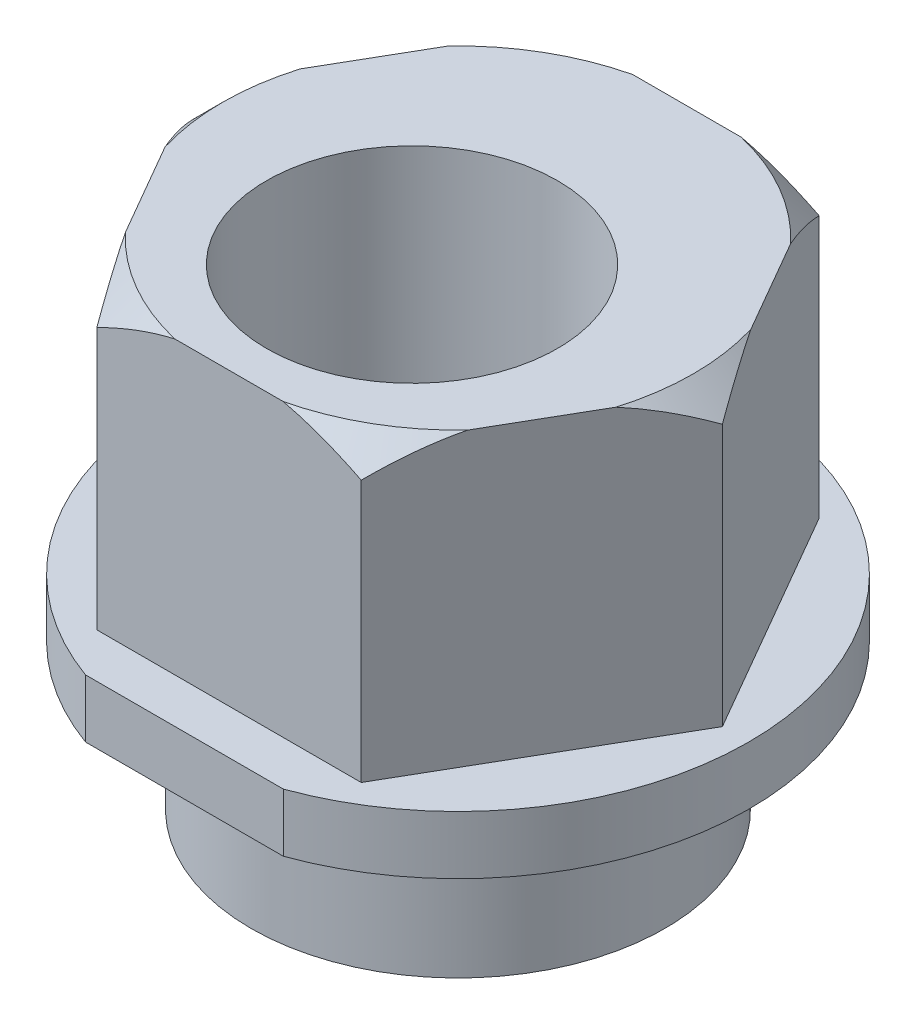
ISO-10303-21;
HEADER;
FILE_DESCRIPTION(('STEP AP214'),'2;1');
FILE_NAME('part.step','',(''),(''),'','','');
FILE_SCHEMA(('AUTOMOTIVE_DESIGN { 1 0 10303 214 1 1 1 1 }'));
ENDSEC;
DATA;
#1=APPLICATION_CONTEXT('core data for automotive mechanical design processes');
#2=APPLICATION_PROTOCOL_DEFINITION('international standard','automotive_design',2000,#1);
#3=PRODUCT_CONTEXT('',#1,'mechanical');
#4=PRODUCT('Part','Part','',(#3));
#5=PRODUCT_RELATED_PRODUCT_CATEGORY('part','',(#4));
#6=PRODUCT_DEFINITION_FORMATION('','',#4);
#7=PRODUCT_DEFINITION_CONTEXT('part definition',#1,'design');
#8=PRODUCT_DEFINITION('design','',#6,#7);
#9=PRODUCT_DEFINITION_SHAPE('','',#8);
#10=(LENGTH_UNIT() NAMED_UNIT(*) SI_UNIT(.MILLI.,.METRE.));
#11=(NAMED_UNIT(*) PLANE_ANGLE_UNIT() SI_UNIT($,.RADIAN.));
#12=(NAMED_UNIT(*) SI_UNIT($,.STERADIAN.) SOLID_ANGLE_UNIT());
#13=UNCERTAINTY_MEASURE_WITH_UNIT(LENGTH_MEASURE(1.E-05),#10,'distance_accuracy_value','');
#14=(GEOMETRIC_REPRESENTATION_CONTEXT(3) GLOBAL_UNCERTAINTY_ASSIGNED_CONTEXT((#13)) GLOBAL_UNIT_ASSIGNED_CONTEXT((#10,
#11,#12)) REPRESENTATION_CONTEXT('',''));
#15=CARTESIAN_POINT('',(0.,0.,0.));
#16=DIRECTION('',(0.,0.,1.));
#17=DIRECTION('',(1.,0.,0.));
#18=AXIS2_PLACEMENT_3D('',#15,#16,#17);
#19=CARTESIAN_POINT('',(0.,-1.,0.));
#20=DIRECTION('',(0.,1.,0.));
#21=DIRECTION('',(0.,0.,1.));
#22=AXIS2_PLACEMENT_3D('',#19,#20,#21);
#23=PLANE('',#22);
#24=CARTESIAN_POINT('',(0.,-1.,0.));
#25=DIRECTION('',(0.,1.,0.));
#26=DIRECTION('',(0.,0.,1.));
#27=AXIS2_PLACEMENT_3D('',#24,#25,#26);
#28=CIRCLE('',#27,5.);
#29=CARTESIAN_POINT('',(1.7,-1.,4.7021271782035));
#30=VERTEX_POINT('',#29);
#31=CARTESIAN_POINT('',(-1.7,-1.,4.7021271782035));
#32=VERTEX_POINT('',#31);
#33=EDGE_CURVE('E221',#30,#32,#28,.T.);
#34=ORIENTED_EDGE('',*,*,#33,.F.);
#35=DIRECTION('',(-1.,0.,0.));
#36=VECTOR('',#35,1.);
#37=CARTESIAN_POINT('',(0.,-1.,4.7021271782035));
#38=LINE('',#37,#36);
#39=EDGE_CURVE('E336',#30,#32,#38,.T.);
#40=ORIENTED_EDGE('',*,*,#39,.T.);
#41=EDGE_LOOP('',(#34,#40));
#42=FACE_BOUND('',#41,.T.);
#43=CARTESIAN_POINT('',(0.,-1.,0.));
#44=DIRECTION('',(0.,1.,0.));
#45=DIRECTION('',(0.,0.,1.));
#46=AXIS2_PLACEMENT_3D('',#43,#44,#45);
#47=CIRCLE('',#46,3.555);
#48=CARTESIAN_POINT('',(0.,-1.,3.555));
#49=VERTEX_POINT('',#48);
#50=EDGE_CURVE('E166',#49,#49,#47,.F.);
#51=ORIENTED_EDGE('',*,*,#50,.F.);
#52=EDGE_LOOP('',(#51));
#53=FACE_BOUND('',#52,.T.);
#54=ADVANCED_FACE('F34',(#42,#53),#23,.F.);
#55=CARTESIAN_POINT('',(2.27187330926118,5.,3.935));
#56=DIRECTION('',(-0.866025403784439,0.,-0.5));
#57=DIRECTION('',(-0.5,0.,0.866025403784439));
#58=AXIS2_PLACEMENT_3D('',#55,#56,#57);
#59=PLANE('',#58);
#60=DIRECTION('',(0.,-1.,0.));
#61=VECTOR('',#60,1.);
#62=CARTESIAN_POINT('',(4.54374661852235,5.,0.));
#63=LINE('',#62,#61);
#64=CARTESIAN_POINT('',(4.54374661852235,4.5,0.));
#65=VERTEX_POINT('',#64);
#66=CARTESIAN_POINT('',(4.54374661852235,0.,0.));
#67=VERTEX_POINT('',#66);
#68=EDGE_CURVE('E163',#65,#67,#63,.T.);
#69=ORIENTED_EDGE('',*,*,#68,.F.);
#70=CARTESIAN_POINT('',(6.12736327266163,2.33046829888115,-2.74290450468147));
#71=CARTESIAN_POINT('',(6.07348339276709,2.4177650828994,-2.64958181519841));
#72=CARTESIAN_POINT('',(6.01938921555573,2.50453762285222,-2.55588795187471));
#73=CARTESIAN_POINT('',(5.91069789973588,2.67683309661582,-2.36762907053321));
#74=CARTESIAN_POINT('',(5.85610071578471,2.76235591593962,-2.27306397397959));
#75=CARTESIAN_POINT('',(5.74620735938589,2.9321379387506,-2.08272309728255));
#76=CARTESIAN_POINT('',(5.6909098259844,3.01639362513631,-1.98694495989795));
#77=CARTESIAN_POINT('',(5.57966030231228,3.18315508159383,-1.79425513258));
#78=CARTESIAN_POINT('',(5.52370832991605,3.26566089928668,-1.69734347360602));
#79=CARTESIAN_POINT('',(5.40948255505868,3.43085092459455,-1.49949862801914));
#80=CARTESIAN_POINT('',(5.3511874452437,3.51347634106705,-1.3985285359868));
#81=CARTESIAN_POINT('',(5.23367321649109,3.67605365317037,-1.194987921175));
#82=CARTESIAN_POINT('',(5.17445413325307,3.75600565172091,-1.09241746022911));
#83=CARTESIAN_POINT('',(5.05499257757878,3.9125743398257,-0.885503976250002));
#84=CARTESIAN_POINT('',(4.99475102957391,3.98919384008597,-0.78116255437897));
#85=CARTESIAN_POINT('',(4.873034492307,4.1383918042904,-0.570343327711337));
#86=CARTESIAN_POINT('',(4.81155966257741,4.21097078637303,-0.463865799233039));
#87=CARTESIAN_POINT('',(4.68581480841085,4.35265115676022,-0.246069323026223));
#88=CARTESIAN_POINT('',(4.62151303943029,4.42164059850529,-0.134695392135335));
#89=CARTESIAN_POINT('',(4.4912183922476,4.55301635986169,0.090981556739347));
#90=CARTESIAN_POINT('',(4.42522527529575,4.61540174079966,0.205284988249787));
#91=CARTESIAN_POINT('',(4.29176890522431,4.73150823576122,0.436438201807242));
#92=CARTESIAN_POINT('',(4.22431561588303,4.78527468558276,0.553270726083977));
#93=CARTESIAN_POINT('',(4.08756303909753,4.88247623364584,0.790133137142428));
#94=CARTESIAN_POINT('',(4.01826431274338,4.92591443311341,0.910162052087628));
#95=CARTESIAN_POINT('',(3.89160680975576,4.99299560676046,1.129539282422));
#96=CARTESIAN_POINT('',(3.83454175212893,5.01884439579798,1.22837886156851));
#97=CARTESIAN_POINT('',(3.71955042243969,5.06126068823275,1.42754968702018));
#98=CARTESIAN_POINT('',(3.66162427680432,5.0778295405829,1.52788071434728));
#99=CARTESIAN_POINT('',(3.54536540774452,5.10083438466152,1.72924698238935));
#100=CARTESIAN_POINT('',(3.4870335640049,5.1072879053957,1.83028069944554));
#101=CARTESIAN_POINT('',(3.37031281221754,5.10976287991731,2.03244697183888));
#102=CARTESIAN_POINT('',(3.31192390350574,5.10578421082689,2.13357952832621));
#103=CARTESIAN_POINT('',(3.19571069696838,5.08764038060559,2.33486670655941));
#104=CARTESIAN_POINT('',(3.13788528988516,5.07350318473267,2.43502324959591));
#105=CARTESIAN_POINT('',(3.02300572590152,5.03579603444199,2.63400049116693));
#106=CARTESIAN_POINT('',(2.96595175572664,5.01222383709666,2.73282086628335));
#107=CARTESIAN_POINT('',(2.85271904802042,4.95661618256865,2.9289456691091));
#108=CARTESIAN_POINT('',(2.79654337792266,4.92455603960202,3.02624478386765));
#109=CARTESIAN_POINT('',(2.68537248742994,4.85318593152667,3.21879841452373));
#110=CARTESIAN_POINT('',(2.63037720983353,4.81387631861451,3.31405302949706));
#111=CARTESIAN_POINT('',(2.5019161833033,4.71383121159169,3.53655405423988));
#112=CARTESIAN_POINT('',(2.42896022795634,4.65048731772351,3.66291747561553));
#113=CARTESIAN_POINT('',(2.28511505424096,4.51496245516658,3.91206462491415));
#114=CARTESIAN_POINT('',(2.2142269607044,4.44277678394606,4.03484640457117));
#115=CARTESIAN_POINT('',(2.07416708594693,4.29140781010891,4.27743722375284));
#116=CARTESIAN_POINT('',(2.00499919286836,4.21221022636325,4.39723952881742));
#117=CARTESIAN_POINT('',(1.86828970424628,4.04847541244671,4.63402730898762));
#118=CARTESIAN_POINT('',(1.80074782327538,3.96393912900212,4.75101327846797));
#119=CARTESIAN_POINT('',(1.6667324101583,3.790255628053,4.9831347829841));
#120=CARTESIAN_POINT('',(1.60026513983173,3.70108917509827,5.09825947223014));
#121=CARTESIAN_POINT('',(1.46849790545969,3.51936003005431,5.32648701693534));
#122=CARTESIAN_POINT('',(1.40319803917282,3.42679705550268,5.43958970307165));
#123=CARTESIAN_POINT('',(1.27366225353528,3.23904020589262,5.66395226519422));
#124=CARTESIAN_POINT('',(1.20942525212282,3.14384930831284,5.77521401536649));
#125=CARTESIAN_POINT('',(1.08179181966025,2.9512386314917,5.99628160513605));
#126=CARTESIAN_POINT('',(1.01839540535985,2.85381880794148,6.10608741572204));
#127=CARTESIAN_POINT('',(0.910409016945997,2.6853578347565,6.2931253269807));
#128=CARTESIAN_POINT('',(0.865642352807006,2.61476846228915,6.3706634637548));
#129=CARTESIAN_POINT('',(0.776622094234247,2.47305833440251,6.52485107450574));
#130=CARTESIAN_POINT('',(0.732367142810404,2.40194099006958,6.60150289885833));
#131=CARTESIAN_POINT('',(0.688256655121896,2.33046829888115,6.67790450468147));
#132=B_SPLINE_CURVE_WITH_KNOTS('',3,(#70,#71,#72,#73,#74,#75,#76,#77,#78,#79,#80,#81,#82,#83,
#84,#85,#86,#87,#88,#89,#90,#91,#92,#93,#94,#95,#96,#97,#98,#99,#100,#101,#102,#103,#104,#105,
#106,#107,#108,#109,#110,#111,#112,#113,#114,#115,#116,#117,#118,#119,#120,#121,#122,#123,#124,
#125,#126,#127,#128,#129,#130,#131),.UNSPECIFIED.,.F.,.F.,(4,2,2,2,2,2,2,2,2,2,2,2,2,2,2,2,2,2,
2,2,2,2,2,2,2,2,2,2,2,2,4),(0.,0.416050988652375,0.832139855784054,1.24922530063749,
1.6662993802975,2.09496685038955,2.52361779884089,2.95189991005181,3.38012697311563,
3.81779500231414,4.25552515650994,4.69087140580247,5.12608676971888,5.4768138337239,
5.82748990199696,6.17755760407587,6.52762942952254,6.87674122143841,7.22593605499141,
7.5761578380004,7.92636261087879,8.40316579002672,8.88022366888807,9.35827656071276,
9.83624491486482,10.316388748245,10.7965726023688,11.2762330860941,11.7559031133002,
12.0979389750605,12.4385584137849),.UNSPECIFIED.);
#133=CARTESIAN_POINT('',(3.87355176865353,5.,1.1608115309438));
#134=VERTEX_POINT('',#133);
#135=EDGE_CURVE('E313',#65,#134,#132,.T.);
#136=ORIENTED_EDGE('',*,*,#135,.T.);
#137=DIRECTION('',(0.5,0.,-0.866025403784439));
#138=VECTOR('',#137,1.);
#139=CARTESIAN_POINT('',(2.27187330926118,5.,3.935));
#140=LINE('',#139,#138);
#141=CARTESIAN_POINT('',(2.94206815913,5.,2.7741884690562));
#142=VERTEX_POINT('',#141);
#143=EDGE_CURVE('E233',#142,#134,#140,.T.);
#144=ORIENTED_EDGE('',*,*,#143,.F.);
#145=CARTESIAN_POINT('',(2.27187330926118,4.5,3.935));
#146=VERTEX_POINT('',#145);
#147=EDGE_CURVE('E250',#142,#146,#132,.T.);
#148=ORIENTED_EDGE('',*,*,#147,.T.);
#149=DIRECTION('',(0.,-1.,0.));
#150=VECTOR('',#149,1.);
#151=CARTESIAN_POINT('',(2.27187330926118,5.,3.935));
#152=LINE('',#151,#150);
#153=CARTESIAN_POINT('',(2.27187330926118,0.,3.935));
#154=VERTEX_POINT('',#153);
#155=EDGE_CURVE('E217',#146,#154,#152,.T.);
#156=ORIENTED_EDGE('',*,*,#155,.T.);
#157=DIRECTION('',(0.5,0.,-0.866025403784439));
#158=VECTOR('',#157,1.);
#159=CARTESIAN_POINT('',(2.27187330926118,0.,3.935));
#160=LINE('',#159,#158);
#161=EDGE_CURVE('E218',#154,#67,#160,.T.);
#162=ORIENTED_EDGE('',*,*,#161,.T.);
#163=EDGE_LOOP('',(#69,#136,#144,#148,#156,#162));
#164=FACE_BOUND('',#163,.T.);
#165=ADVANCED_FACE('F36',(#164),#59,.F.);
#166=CARTESIAN_POINT('',(4.54374661852235,5.,0.));
#167=DIRECTION('',(-0.866025403784438,0.,0.5));
#168=DIRECTION('',(0.5,0.,0.866025403784438));
#169=AXIS2_PLACEMENT_3D('',#166,#167,#168);
#170=PLANE('',#169);
#171=DIRECTION('',(0.,-1.,0.));
#172=VECTOR('',#171,1.);
#173=CARTESIAN_POINT('',(2.27187330926118,5.,-3.935));
#174=LINE('',#173,#172);
#175=CARTESIAN_POINT('',(2.27187330926118,4.5,-3.935));
#176=VERTEX_POINT('',#175);
#177=CARTESIAN_POINT('',(2.27187330926118,0.,-3.935));
#178=VERTEX_POINT('',#177);
#179=EDGE_CURVE('E152',#176,#178,#174,.T.);
#180=ORIENTED_EDGE('',*,*,#179,.F.);
#181=CARTESIAN_POINT('',(0.688256655121894,2.33046829888116,-6.67790450468146));
#182=CARTESIAN_POINT('',(0.742136535016436,2.4177650828994,-6.58458181519841));
#183=CARTESIAN_POINT('',(0.796230712227795,2.50453762285222,-6.4908879518747));
#184=CARTESIAN_POINT('',(0.904922028047648,2.67683309661582,-6.3026290705332));
#185=CARTESIAN_POINT('',(0.959519211998818,2.76235591593963,-6.20806397397959));
#186=CARTESIAN_POINT('',(1.06941256839764,2.93213793875061,-6.01772309728255));
#187=CARTESIAN_POINT('',(1.12471010179913,3.01639362513632,-5.92194495989794));
#188=CARTESIAN_POINT('',(1.23595962547125,3.18315508159383,-5.72925513257999));
#189=CARTESIAN_POINT('',(1.29191159786749,3.26566089928668,-5.63234347360602));
#190=CARTESIAN_POINT('',(1.40613737272485,3.43085092459456,-5.43449862801913));
#191=CARTESIAN_POINT('',(1.46443248253983,3.51347634106706,-5.33352853598679));
#192=CARTESIAN_POINT('',(1.58194671129244,3.67605365317038,-5.12998792117499));
#193=CARTESIAN_POINT('',(1.64116579453046,3.75600565172092,-5.0274174602291));
#194=CARTESIAN_POINT('',(1.76062735020476,3.9125743398257,-4.82050397624999));
#195=CARTESIAN_POINT('',(1.82086889820963,3.98919384008598,-4.71616255437896));
#196=CARTESIAN_POINT('',(1.94258543547653,4.1383918042904,-4.50534332771133));
#197=CARTESIAN_POINT('',(2.00406026520612,4.21097078637303,-4.39886579923303));
#198=CARTESIAN_POINT('',(2.12980511937268,4.35265115676022,-4.18106932302621));
#199=CARTESIAN_POINT('',(2.19410688835324,4.4216405985053,-4.06969539213533));
#200=CARTESIAN_POINT('',(2.32440153553593,4.5530163598617,-3.84401844326064));
#201=CARTESIAN_POINT('',(2.39039465248778,4.61540174079966,-3.7297150117502));
#202=CARTESIAN_POINT('',(2.52385102255923,4.73150823576123,-3.49856179819275));
#203=CARTESIAN_POINT('',(2.5913043119005,4.78527468558276,-3.38172927391602));
#204=CARTESIAN_POINT('',(2.728056888686,4.88247623364584,-3.14486686285757));
#205=CARTESIAN_POINT('',(2.79735561504015,4.92591443311342,-3.02483794791237));
#206=CARTESIAN_POINT('',(2.92401311802778,4.99299560676046,-2.805460717578));
#207=CARTESIAN_POINT('',(2.98107817565461,5.01884439579799,-2.70662113843148));
#208=CARTESIAN_POINT('',(3.09606950534385,5.06126068823276,-2.50745031297981));
#209=CARTESIAN_POINT('',(3.15399565097922,5.0778295405829,-2.40711928565272));
#210=CARTESIAN_POINT('',(3.27025452003902,5.10083438466152,-2.20575301761065));
#211=CARTESIAN_POINT('',(3.32858636377864,5.1072879053957,-2.10471930055446));
#212=CARTESIAN_POINT('',(3.445307115566,5.10976287991731,-1.90255302816112));
#213=CARTESIAN_POINT('',(3.50369602427779,5.10578421082689,-1.80142047167379));
#214=CARTESIAN_POINT('',(3.61990923081515,5.08764038060559,-1.60013329344058));
#215=CARTESIAN_POINT('',(3.67773463789837,5.07350318473267,-1.49997675040409));
#216=CARTESIAN_POINT('',(3.79261420188202,5.03579603444199,-1.30099950883306));
#217=CARTESIAN_POINT('',(3.8496681720569,5.01222383709666,-1.20217913371665));
#218=CARTESIAN_POINT('',(3.96290087976311,4.95661618256865,-1.00605433089089));
#219=CARTESIAN_POINT('',(4.01907654986087,4.92455603960202,-0.908755216132345));
#220=CARTESIAN_POINT('',(4.13024744035359,4.85318593152667,-0.716201585476272));
#221=CARTESIAN_POINT('',(4.18524271795,4.81387631861451,-0.620946970502936));
#222=CARTESIAN_POINT('',(4.31370374448024,4.71383121159169,-0.398445945760117));
#223=CARTESIAN_POINT('',(4.38665969982719,4.6504873177235,-0.272082524384468));
#224=CARTESIAN_POINT('',(4.53050487354258,4.51496245516658,-0.0229353750858439));
#225=CARTESIAN_POINT('',(4.60139296707914,4.44277678394605,0.0998464045711766));
#226=CARTESIAN_POINT('',(4.74145284183661,4.2914078101089,0.342437223752842));
#227=CARTESIAN_POINT('',(4.81062073491518,4.21221022636324,0.462239528817422));
#228=CARTESIAN_POINT('',(4.94733022353726,4.0484754124467,0.699027308987622));
#229=CARTESIAN_POINT('',(5.01487210450815,3.96393912900211,0.81601327846798));
#230=CARTESIAN_POINT('',(5.14888751762524,3.79025562805299,1.04813478298411));
#231=CARTESIAN_POINT('',(5.21535478795181,3.70108917509827,1.16325947223014));
#232=CARTESIAN_POINT('',(5.34712202232385,3.5193600300543,1.39148701693534));
#233=CARTESIAN_POINT('',(5.41242188861072,3.42679705550267,1.50458970307166));
#234=CARTESIAN_POINT('',(5.54195767424825,3.23904020589262,1.72895226519422));
#235=CARTESIAN_POINT('',(5.60619467566072,3.14384930831283,1.84021401536649));
#236=CARTESIAN_POINT('',(5.73382810812329,2.95123863149169,2.06128160513606));
#237=CARTESIAN_POINT('',(5.79722452242369,2.85381880794147,2.17108741572204));
#238=CARTESIAN_POINT('',(5.90521091083754,2.68535783475649,2.3581253269807));
#239=CARTESIAN_POINT('',(5.94997757497653,2.61476846228915,2.43566346375481));
#240=CARTESIAN_POINT('',(6.03899783354929,2.47305833440251,2.58985107450574));
#241=CARTESIAN_POINT('',(6.08325278497313,2.40194099006958,2.66650289885833));
#242=CARTESIAN_POINT('',(6.12736327266164,2.33046829888115,2.74290450468146));
#243=B_SPLINE_CURVE_WITH_KNOTS('',3,(#181,#182,#183,#184,#185,#186,#187,#188,#189,#190,#191,
#192,#193,#194,#195,#196,#197,#198,#199,#200,#201,#202,#203,#204,#205,#206,#207,#208,#209,#210,
#211,#212,#213,#214,#215,#216,#217,#218,#219,#220,#221,#222,#223,#224,#225,#226,#227,#228,#229,
#230,#231,#232,#233,#234,#235,#236,#237,#238,#239,#240,#241,#242),.UNSPECIFIED.,.F.,.F.,(4,2,2,
2,2,2,2,2,2,2,2,2,2,2,2,2,2,2,2,2,2,2,2,2,2,2,2,2,2,2,4),(0.,0.416050988652376,
0.832139855784055,1.24922530063749,1.66629938029751,2.09496685038956,2.5236177988409,
2.95189991005182,3.38012697311563,3.81779500231415,4.25552515650994,4.69087140580247,
5.12608676971889,5.4768138337239,5.82748990199696,6.17755760407587,6.52762942952254,
6.87674122143841,7.22593605499141,7.57615783800039,7.92636261087879,8.40316579002672,
8.88022366888807,9.35827656071276,9.83624491486482,10.316388748245,10.7965726023688,
11.2762330860941,11.7559031133002,12.0979389750605,12.4385584137849),.UNSPECIFIED.);
#244=CARTESIAN_POINT('',(2.94206815913,5.,-2.7741884690562));
#245=VERTEX_POINT('',#244);
#246=EDGE_CURVE('E135',#176,#245,#243,.T.);
#247=ORIENTED_EDGE('',*,*,#246,.T.);
#248=DIRECTION('',(-0.5,0.,-0.866025403784438));
#249=VECTOR('',#248,1.);
#250=CARTESIAN_POINT('',(4.54374661852235,5.,0.));
#251=LINE('',#250,#249);
#252=CARTESIAN_POINT('',(3.87355176865353,5.,-1.1608115309438));
#253=VERTEX_POINT('',#252);
#254=EDGE_CURVE('E211',#253,#245,#251,.T.);
#255=ORIENTED_EDGE('',*,*,#254,.F.);
#256=EDGE_CURVE('E145',#253,#65,#243,.T.);
#257=ORIENTED_EDGE('',*,*,#256,.T.);
#258=ORIENTED_EDGE('',*,*,#68,.T.);
#259=DIRECTION('',(-0.5,0.,-0.866025403784438));
#260=VECTOR('',#259,1.);
#261=CARTESIAN_POINT('',(4.54374661852235,0.,0.));
#262=LINE('',#261,#260);
#263=EDGE_CURVE('E162',#67,#178,#262,.T.);
#264=ORIENTED_EDGE('',*,*,#263,.T.);
#265=EDGE_LOOP('',(#180,#247,#255,#257,#258,#264));
#266=FACE_BOUND('',#265,.T.);
#267=ADVANCED_FACE('F160',(#266),#170,.F.);
#268=CARTESIAN_POINT('',(2.27187330926118,5.,-3.935));
#269=DIRECTION('',(0.,0.,1.));
#270=DIRECTION('',(1.,0.,0.));
#271=AXIS2_PLACEMENT_3D('',#268,#269,#270);
#272=PLANE('',#271);
#273=DIRECTION('',(0.,-1.,0.));
#274=VECTOR('',#273,1.);
#275=CARTESIAN_POINT('',(-2.27187330926118,5.,-3.935));
#276=LINE('',#275,#274);
#277=CARTESIAN_POINT('',(-2.27187330926118,4.5,-3.935));
#278=VERTEX_POINT('',#277);
#279=CARTESIAN_POINT('',(-2.27187330926118,0.,-3.935));
#280=VERTEX_POINT('',#279);
#281=EDGE_CURVE('E164',#278,#280,#276,.T.);
#282=ORIENTED_EDGE('',*,*,#281,.F.);
#283=CARTESIAN_POINT('',(-5.01477781394264,2.6694057488158,-3.935));
#284=CARTESIAN_POINT('',(-4.90228240032233,2.75789162999437,-3.935));
#285=CARTESIAN_POINT('',(-4.78924605492269,2.84569863662638,-3.935));
#286=CARTESIAN_POINT('',(-4.56188241632701,3.01966288534844,-3.935));
#287=CARTESIAN_POINT('',(-4.44755491307628,3.10581985266844,-3.935));
#288=CARTESIAN_POINT('',(-4.21685222046402,3.27659538663721,-3.935));
#289=CARTESIAN_POINT('',(-4.10046957789372,3.36120391114583,-3.935));
#290=CARTESIAN_POINT('',(-3.86599418351296,3.52801066974508,-3.935));
#291=CARTESIAN_POINT('',(-3.74790151420127,3.61020901953759,-3.935));
#292=CARTESIAN_POINT('',(-3.50380543280417,3.77568927594522,-3.935));
#293=CARTESIAN_POINT('',(-3.3777005297054,3.85882204730453,-3.935));
#294=CARTESIAN_POINT('',(-3.12293409141574,4.0210686075328,-3.935));
#295=CARTESIAN_POINT('',(-2.99427277147477,4.10018273279293,-3.935));
#296=CARTESIAN_POINT('',(-2.7342134500717,4.25322326602883,-3.935));
#297=CARTESIAN_POINT('',(-2.60282112402671,4.32715926211431,-3.935));
#298=CARTESIAN_POINT('',(-2.33665993470769,4.46865096658867,-3.935));
#299=CARTESIAN_POINT('',(-2.20189200633557,4.53620841737975,-3.935));
#300=CARTESIAN_POINT('',(-1.94277039794665,4.65662539379787,-3.935));
#301=CARTESIAN_POINT('',(-1.81879024517606,4.7102827638368,-3.935));
#302=CARTESIAN_POINT('',(-1.56760322182998,4.80956431437058,-3.935));
#303=CARTESIAN_POINT('',(-1.4403960426367,4.8551877231961,-3.935));
#304=CARTESIAN_POINT('',(-1.18430895439847,4.93616339546024,-3.935));
#305=CARTESIAN_POINT('',(-1.05546474171029,4.97162701315895,-3.935));
#306=CARTESIAN_POINT('',(-0.795188728182397,5.03120060018271,-3.935));
#307=CARTESIAN_POINT('',(-0.663757985336443,5.05531511515621,-3.935));
#308=CARTESIAN_POINT('',(-0.39667530812576,5.09105643721047,-3.935));
#309=CARTESIAN_POINT('',(-0.260990364554486,5.10244193256667,-3.935));
#310=CARTESIAN_POINT('',(0.0108256286758382,5.11107629854814,-3.935));
#311=CARTESIAN_POINT('',(0.146956639108313,5.10832638056083,-3.935));
#312=CARTESIAN_POINT('',(0.418619878870053,5.08887050209526,-3.935));
#313=CARTESIAN_POINT('',(0.554148970208934,5.0721215602934,-3.935));
#314=CARTESIAN_POINT('',(0.822982454746628,5.02579152850102,-3.935));
#315=CARTESIAN_POINT('',(0.956286242224141,4.99620700199297,-3.935));
#316=CARTESIAN_POINT('',(1.26105655280132,4.91498323631563,-3.935));
#317=CARTESIAN_POINT('',(1.43144793684183,4.85934235740488,-3.935));
#318=CARTESIAN_POINT('',(1.76659971199313,4.73318715507506,-3.935));
#319=CARTESIAN_POINT('',(1.93135663408204,4.66266385383244,-3.935));
#320=CARTESIAN_POINT('',(2.25670464302017,4.50985567629177,-3.935));
#321=CARTESIAN_POINT('',(2.41725700907644,4.42748946751823,-3.935));
#322=CARTESIAN_POINT('',(2.7335996666453,4.25424890954647,-3.935));
#323=CARTESIAN_POINT('',(2.88939106725242,4.16337656225559,-3.935));
#324=CARTESIAN_POINT('',(3.2171018287942,3.96289685347115,-3.935));
#325=CARTESIAN_POINT('',(3.38846902004868,3.85239290462363,-3.935));
#326=CARTESIAN_POINT('',(3.7271209143155,3.62526903861077,-3.935));
#327=CARTESIAN_POINT('',(3.89440474117752,3.50864782550207,-3.935));
#328=CARTESIAN_POINT('',(4.22200861608271,3.27340163426143,-3.935));
#329=CARTESIAN_POINT('',(4.38240091884256,3.15487687320021,-3.935));
#330=CARTESIAN_POINT('',(4.6209837589724,2.97456068361506,-3.935));
#331=CARTESIAN_POINT('',(4.70015123515769,2.91405422097405,-3.935));
#332=CARTESIAN_POINT('',(4.85789331048121,2.79227931530866,-3.935));
#333=CARTESIAN_POINT('',(4.93646793238964,2.73101090179094,-3.935));
#334=CARTESIAN_POINT('',(5.01477781394264,2.6694057488158,-3.935));
#335=B_SPLINE_CURVE_WITH_KNOTS('',3,(#283,#284,#285,#286,#287,#288,#289,#290,#291,#292,#293,
#294,#295,#296,#297,#298,#299,#300,#301,#302,#303,#304,#305,#306,#307,#308,#309,#310,#311,#312,
#313,#314,#315,#316,#317,#318,#319,#320,#321,#322,#323,#324,#325,#326,#327,#328,#329,#330,#331,
#332,#333,#334),.UNSPECIFIED.,.F.,.F.,(4,2,2,2,2,2,2,2,2,2,2,2,2,2,2,2,2,2,2,2,2,2,2,2,2,4),(0.,
0.429382623340998,0.858836137877717,1.29047192805164,1.72208696325132,2.17515026344406,
2.62817557609088,3.08033856015113,3.53237766908385,3.9374314291705,4.34252407384557,
4.74299021725164,5.14329582542998,5.55106798246257,5.95880519450876,6.36779890408527,
6.77690218266532,7.31369645202257,7.85081547305105,8.39181700182992,8.932691525285,
9.54423171138721,10.15590197977,10.7541421331558,11.0530644250241,11.35197517691),.UNSPECIFIED.);
#336=CARTESIAN_POINT('',(-0.931483609523527,5.,-3.935));
#337=VERTEX_POINT('',#336);
#338=EDGE_CURVE('E157',#278,#337,#335,.T.);
#339=ORIENTED_EDGE('',*,*,#338,.T.);
#340=DIRECTION('',(-1.,0.,0.));
#341=VECTOR('',#340,1.);
#342=CARTESIAN_POINT('',(2.27187330926118,5.,-3.935));
#343=LINE('',#342,#341);
#344=CARTESIAN_POINT('',(0.931483609523526,5.,-3.935));
#345=VERTEX_POINT('',#344);
#346=EDGE_CURVE('E156',#345,#337,#343,.T.);
#347=ORIENTED_EDGE('',*,*,#346,.F.);
#348=EDGE_CURVE('E138',#345,#176,#335,.T.);
#349=ORIENTED_EDGE('',*,*,#348,.T.);
#350=ORIENTED_EDGE('',*,*,#179,.T.);
#351=DIRECTION('',(-1.,0.,0.));
#352=VECTOR('',#351,1.);
#353=CARTESIAN_POINT('',(2.27187330926118,0.,-3.935));
#354=LINE('',#353,#352);
#355=EDGE_CURVE('E223',#178,#280,#354,.T.);
#356=ORIENTED_EDGE('',*,*,#355,.T.);
#357=EDGE_LOOP('',(#282,#339,#347,#349,#350,#356));
#358=FACE_BOUND('',#357,.T.);
#359=ADVANCED_FACE('F150',(#358),#272,.F.);
#360=CARTESIAN_POINT('',(-2.27187330926118,5.,-3.935));
#361=DIRECTION('',(0.866025403784438,0.,0.5));
#362=DIRECTION('',(0.5,0.,-0.866025403784439));
#363=AXIS2_PLACEMENT_3D('',#360,#361,#362);
#364=PLANE('',#363);
#365=DIRECTION('',(0.,-1.,0.));
#366=VECTOR('',#365,1.);
#367=CARTESIAN_POINT('',(-4.54374661852235,5.,0.));
#368=LINE('',#367,#366);
#369=CARTESIAN_POINT('',(-4.54374661852235,4.5,0.));
#370=VERTEX_POINT('',#369);
#371=CARTESIAN_POINT('',(-4.54374661852235,0.,0.));
#372=VERTEX_POINT('',#371);
#373=EDGE_CURVE('E168',#370,#372,#368,.T.);
#374=ORIENTED_EDGE('',*,*,#373,.F.);
#375=CARTESIAN_POINT('',(-6.12736327266164,2.33046829888115,2.74290450468147));
#376=CARTESIAN_POINT('',(-6.07348339276709,2.4177650828994,2.64958181519841));
#377=CARTESIAN_POINT('',(-6.01938921555574,2.50453762285222,2.5558879518747));
#378=CARTESIAN_POINT('',(-5.91069789973588,2.67683309661582,2.3676290705332));
#379=CARTESIAN_POINT('',(-5.85610071578471,2.76235591593963,2.27306397397959));
#380=CARTESIAN_POINT('',(-5.74620735938589,2.9321379387506,2.08272309728255));
#381=CARTESIAN_POINT('',(-5.6909098259844,3.01639362513631,1.98694495989795));
#382=CARTESIAN_POINT('',(-5.57966030231228,3.18315508159383,1.79425513257999));
#383=CARTESIAN_POINT('',(-5.52370832991604,3.26566089928668,1.69734347360602));
#384=CARTESIAN_POINT('',(-5.40948255505868,3.43085092459455,1.49949862801913));
#385=CARTESIAN_POINT('',(-5.3511874452437,3.51347634106705,1.39852853598679));
#386=CARTESIAN_POINT('',(-5.23367321649109,3.67605365317037,1.19498792117499));
#387=CARTESIAN_POINT('',(-5.17445413325307,3.75600565172092,1.0924174602291));
#388=CARTESIAN_POINT('',(-5.05499257757878,3.9125743398257,0.885503976249998));
#389=CARTESIAN_POINT('',(-4.99475102957391,3.98919384008598,0.781162554378965));
#390=CARTESIAN_POINT('',(-4.873034492307,4.1383918042904,0.570343327711332));
#391=CARTESIAN_POINT('',(-4.81155966257741,4.21097078637303,0.463865799233036));
#392=CARTESIAN_POINT('',(-4.68581480841085,4.35265115676022,0.24606932302622));
#393=CARTESIAN_POINT('',(-4.62151303943029,4.42164059850529,0.134695392135332));
#394=CARTESIAN_POINT('',(-4.4912183922476,4.55301635986169,-0.0909815567393509));
#395=CARTESIAN_POINT('',(-4.42522527529575,4.61540174079966,-0.205284988249791));
#396=CARTESIAN_POINT('',(-4.2917689052243,4.73150823576122,-0.436438201807246));
#397=CARTESIAN_POINT('',(-4.22431561588303,4.78527468558276,-0.553270726083981));
#398=CARTESIAN_POINT('',(-4.08756303909753,4.88247623364584,-0.790133137142432));
#399=CARTESIAN_POINT('',(-4.01826431274338,4.92591443311341,-0.910162052087631));
#400=CARTESIAN_POINT('',(-3.89160680975576,4.99299560676046,-1.129539282422));
#401=CARTESIAN_POINT('',(-3.83454175212893,5.01884439579798,-1.22837886156851));
#402=CARTESIAN_POINT('',(-3.71955042243968,5.06126068823275,-1.42754968702018));
#403=CARTESIAN_POINT('',(-3.66162427680432,5.0778295405829,-1.52788071434728));
#404=CARTESIAN_POINT('',(-3.54536540774451,5.10083438466152,-1.72924698238935));
#405=CARTESIAN_POINT('',(-3.48703356400489,5.1072879053957,-1.83028069944554));
#406=CARTESIAN_POINT('',(-3.37031281221754,5.10976287991731,-2.03244697183888));
#407=CARTESIAN_POINT('',(-3.31192390350574,5.10578421082689,-2.13357952832621));
#408=CARTESIAN_POINT('',(-3.19571069696838,5.08764038060559,-2.33486670655941));
#409=CARTESIAN_POINT('',(-3.13788528988516,5.07350318473267,-2.43502324959591));
#410=CARTESIAN_POINT('',(-3.02300572590152,5.03579603444199,-2.63400049116693));
#411=CARTESIAN_POINT('',(-2.96595175572664,5.01222383709666,-2.73282086628335));
#412=CARTESIAN_POINT('',(-2.85271904802042,4.95661618256865,-2.9289456691091));
#413=CARTESIAN_POINT('',(-2.79654337792266,4.92455603960202,-3.02624478386765));
#414=CARTESIAN_POINT('',(-2.68537248742994,4.85318593152667,-3.21879841452372));
#415=CARTESIAN_POINT('',(-2.63037720983353,4.81387631861451,-3.31405302949706));
#416=CARTESIAN_POINT('',(-2.5019161833033,4.71383121159169,-3.53655405423988));
#417=CARTESIAN_POINT('',(-2.42896022795634,4.65048731772351,-3.66291747561553));
#418=CARTESIAN_POINT('',(-2.28511505424096,4.51496245516658,-3.91206462491415));
#419=CARTESIAN_POINT('',(-2.21422696070439,4.44277678394606,-4.03484640457117));
#420=CARTESIAN_POINT('',(-2.07416708594693,4.29140781010891,-4.27743722375283));
#421=CARTESIAN_POINT('',(-2.00499919286836,4.21221022636325,-4.39723952881741));
#422=CARTESIAN_POINT('',(-1.86828970424628,4.04847541244671,-4.63402730898761));
#423=CARTESIAN_POINT('',(-1.80074782327538,3.96393912900212,-4.75101327846797));
#424=CARTESIAN_POINT('',(-1.6667324101583,3.790255628053,-4.9831347829841));
#425=CARTESIAN_POINT('',(-1.60026513983173,3.70108917509828,-5.09825947223013));
#426=CARTESIAN_POINT('',(-1.46849790545969,3.51936003005432,-5.32648701693533));
#427=CARTESIAN_POINT('',(-1.40319803917282,3.42679705550269,-5.43958970307165));
#428=CARTESIAN_POINT('',(-1.27366225353529,3.23904020589263,-5.66395226519421));
#429=CARTESIAN_POINT('',(-1.20942525212282,3.14384930831284,-5.77521401536648));
#430=CARTESIAN_POINT('',(-1.08179181966026,2.95123863149171,-5.99628160513604));
#431=CARTESIAN_POINT('',(-1.01839540535985,2.85381880794148,-6.10608741572203));
#432=CARTESIAN_POINT('',(-0.910409016945998,2.68535783475651,-6.29312532698069));
#433=CARTESIAN_POINT('',(-0.865642352807006,2.61476846228916,-6.3706634637548));
#434=CARTESIAN_POINT('',(-0.776622094234247,2.47305833440251,-6.52485107450573));
#435=CARTESIAN_POINT('',(-0.732367142810403,2.40194099006959,-6.60150289885832));
#436=CARTESIAN_POINT('',(-0.688256655121894,2.33046829888116,-6.67790450468146));
#437=B_SPLINE_CURVE_WITH_KNOTS('',3,(#375,#376,#377,#378,#379,#380,#381,#382,#383,#384,#385,
#386,#387,#388,#389,#390,#391,#392,#393,#394,#395,#396,#397,#398,#399,#400,#401,#402,#403,#404,
#405,#406,#407,#408,#409,#410,#411,#412,#413,#414,#415,#416,#417,#418,#419,#420,#421,#422,#423,
#424,#425,#426,#427,#428,#429,#430,#431,#432,#433,#434,#435,#436),.UNSPECIFIED.,.F.,.F.,(4,2,2,
2,2,2,2,2,2,2,2,2,2,2,2,2,2,2,2,2,2,2,2,2,2,2,2,2,2,2,4),(0.,0.416050988652376,
0.832139855784055,1.24922530063749,1.66629938029751,2.09496685038956,2.5236177988409,
2.95189991005181,3.38012697311563,3.81779500231415,4.25552515650994,4.69087140580247,
5.12608676971889,5.4768138337239,5.82748990199696,6.17755760407587,6.52762942952254,
6.87674122143841,7.22593605499141,7.57615783800039,7.92636261087879,8.40316579002672,
8.88022366888806,9.35827656071275,9.83624491486481,10.316388748245,10.7965726023688,
11.276233086094,11.7559031133002,12.0979389750605,12.4385584137849),.UNSPECIFIED.);
#438=CARTESIAN_POINT('',(-3.87355176865353,5.,-1.1608115309438));
#439=VERTEX_POINT('',#438);
#440=EDGE_CURVE('E191',#370,#439,#437,.T.);
#441=ORIENTED_EDGE('',*,*,#440,.T.);
#442=DIRECTION('',(-0.5,0.,0.866025403784439));
#443=VECTOR('',#442,1.);
#444=CARTESIAN_POINT('',(-2.27187330926118,5.,-3.935));
#445=LINE('',#444,#443);
#446=CARTESIAN_POINT('',(-2.94206815913,5.,-2.7741884690562));
#447=VERTEX_POINT('',#446);
#448=EDGE_CURVE('E201',#447,#439,#445,.T.);
#449=ORIENTED_EDGE('',*,*,#448,.F.);
#450=EDGE_CURVE('E203',#447,#278,#437,.T.);
#451=ORIENTED_EDGE('',*,*,#450,.T.);
#452=ORIENTED_EDGE('',*,*,#281,.T.);
#453=DIRECTION('',(-0.5,0.,0.866025403784439));
#454=VECTOR('',#453,1.);
#455=CARTESIAN_POINT('',(-2.27187330926118,0.,-3.935));
#456=LINE('',#455,#454);
#457=EDGE_CURVE('E225',#280,#372,#456,.T.);
#458=ORIENTED_EDGE('',*,*,#457,.T.);
#459=EDGE_LOOP('',(#374,#441,#449,#451,#452,#458));
#460=FACE_BOUND('',#459,.T.);
#461=ADVANCED_FACE('F199',(#460),#364,.F.);
#462=CARTESIAN_POINT('',(-4.54374661852235,5.,0.));
#463=DIRECTION('',(0.866025403784438,0.,-0.5));
#464=DIRECTION('',(-0.5,0.,-0.866025403784439));
#465=AXIS2_PLACEMENT_3D('',#462,#463,#464);
#466=PLANE('',#465);
#467=DIRECTION('',(0.,-1.,0.));
#468=VECTOR('',#467,1.);
#469=CARTESIAN_POINT('',(-2.27187330926118,5.,3.935));
#470=LINE('',#469,#468);
#471=CARTESIAN_POINT('',(-2.27187330926118,4.5,3.935));
#472=VERTEX_POINT('',#471);
#473=CARTESIAN_POINT('',(-2.27187330926118,0.,3.935));
#474=VERTEX_POINT('',#473);
#475=EDGE_CURVE('E235',#472,#474,#470,.T.);
#476=ORIENTED_EDGE('',*,*,#475,.F.);
#477=CARTESIAN_POINT('',(-0.688256655121893,2.33046829888115,6.67790450468147));
#478=CARTESIAN_POINT('',(-0.742136535016436,2.4177650828994,6.58458181519841));
#479=CARTESIAN_POINT('',(-0.796230712227795,2.50453762285222,6.4908879518747));
#480=CARTESIAN_POINT('',(-0.904922028047647,2.67683309661582,6.3026290705332));
#481=CARTESIAN_POINT('',(-0.959519211998818,2.76235591593963,6.20806397397959));
#482=CARTESIAN_POINT('',(-1.06941256839764,2.9321379387506,6.01772309728255));
#483=CARTESIAN_POINT('',(-1.12471010179913,3.01639362513631,5.92194495989795));
#484=CARTESIAN_POINT('',(-1.23595962547125,3.18315508159383,5.72925513257999));
#485=CARTESIAN_POINT('',(-1.29191159786748,3.26566089928668,5.63234347360602));
#486=CARTESIAN_POINT('',(-1.40613737272485,3.43085092459455,5.43449862801913));
#487=CARTESIAN_POINT('',(-1.46443248253983,3.51347634106705,5.33352853598679));
#488=CARTESIAN_POINT('',(-1.58194671129244,3.67605365317037,5.12998792117499));
#489=CARTESIAN_POINT('',(-1.64116579453046,3.75600565172092,5.0274174602291));
#490=CARTESIAN_POINT('',(-1.76062735020475,3.9125743398257,4.82050397625));
#491=CARTESIAN_POINT('',(-1.82086889820962,3.98919384008598,4.71616255437897));
#492=CARTESIAN_POINT('',(-1.94258543547653,4.1383918042904,4.50534332771133));
#493=CARTESIAN_POINT('',(-2.00406026520612,4.21097078637303,4.39886579923304));
#494=CARTESIAN_POINT('',(-2.12980511937268,4.35265115676022,4.18106932302622));
#495=CARTESIAN_POINT('',(-2.19410688835324,4.42164059850529,4.06969539213533));
#496=CARTESIAN_POINT('',(-2.32440153553593,4.55301635986169,3.84401844326065));
#497=CARTESIAN_POINT('',(-2.39039465248778,4.61540174079966,3.72971501175021));
#498=CARTESIAN_POINT('',(-2.52385102255923,4.73150823576122,3.49856179819275));
#499=CARTESIAN_POINT('',(-2.5913043119005,4.78527468558276,3.38172927391602));
#500=CARTESIAN_POINT('',(-2.728056888686,4.88247623364584,3.14486686285757));
#501=CARTESIAN_POINT('',(-2.79735561504015,4.92591443311341,3.02483794791237));
#502=CARTESIAN_POINT('',(-2.92401311802777,4.99299560676046,2.805460717578));
#503=CARTESIAN_POINT('',(-2.9810781756546,5.01884439579798,2.70662113843149));
#504=CARTESIAN_POINT('',(-3.09606950534385,5.06126068823275,2.50745031297982));
#505=CARTESIAN_POINT('',(-3.15399565097921,5.0778295405829,2.40711928565272));
#506=CARTESIAN_POINT('',(-3.27025452003902,5.10083438466152,2.20575301761065));
#507=CARTESIAN_POINT('',(-3.32858636377864,5.1072879053957,2.10471930055446));
#508=CARTESIAN_POINT('',(-3.44530711556599,5.10976287991731,1.90255302816112));
#509=CARTESIAN_POINT('',(-3.50369602427779,5.10578421082689,1.80142047167379));
#510=CARTESIAN_POINT('',(-3.61990923081515,5.08764038060559,1.60013329344058));
#511=CARTESIAN_POINT('',(-3.67773463789837,5.07350318473267,1.49997675040409));
#512=CARTESIAN_POINT('',(-3.79261420188201,5.03579603444199,1.30099950883306));
#513=CARTESIAN_POINT('',(-3.84966817205689,5.01222383709666,1.20217913371665));
#514=CARTESIAN_POINT('',(-3.96290087976311,4.95661618256865,1.0060543308909));
#515=CARTESIAN_POINT('',(-4.01907654986087,4.92455603960202,0.908755216132348));
#516=CARTESIAN_POINT('',(-4.13024744035359,4.85318593152667,0.716201585476275));
#517=CARTESIAN_POINT('',(-4.18524271795,4.81387631861451,0.620946970502938));
#518=CARTESIAN_POINT('',(-4.31370374448024,4.71383121159169,0.39844594576012));
#519=CARTESIAN_POINT('',(-4.38665969982719,4.65048731772351,0.272082524384471));
#520=CARTESIAN_POINT('',(-4.53050487354258,4.51496245516658,0.0229353750858478));
#521=CARTESIAN_POINT('',(-4.60139296707914,4.44277678394605,-0.0998464045711718));
#522=CARTESIAN_POINT('',(-4.7414528418366,4.2914078101089,-0.342437223752836));
#523=CARTESIAN_POINT('',(-4.81062073491518,4.21221022636325,-0.462239528817416));
#524=CARTESIAN_POINT('',(-4.94733022353725,4.04847541244671,-0.699027308987616));
#525=CARTESIAN_POINT('',(-5.01487210450815,3.96393912900212,-0.816013278467974));
#526=CARTESIAN_POINT('',(-5.14888751762524,3.790255628053,-1.0481347829841));
#527=CARTESIAN_POINT('',(-5.21535478795181,3.70108917509827,-1.16325947223014));
#528=CARTESIAN_POINT('',(-5.34712202232384,3.51936003005431,-1.39148701693534));
#529=CARTESIAN_POINT('',(-5.41242188861071,3.42679705550268,-1.50458970307165));
#530=CARTESIAN_POINT('',(-5.54195767424825,3.23904020589263,-1.72895226519421));
#531=CARTESIAN_POINT('',(-5.60619467566072,3.14384930831284,-1.84021401536648));
#532=CARTESIAN_POINT('',(-5.73382810812328,2.9512386314917,-2.06128160513605));
#533=CARTESIAN_POINT('',(-5.79722452242368,2.85381880794148,-2.17108741572204));
#534=CARTESIAN_POINT('',(-5.90521091083754,2.6853578347565,-2.3581253269807));
#535=CARTESIAN_POINT('',(-5.94997757497653,2.61476846228915,-2.4356634637548));
#536=CARTESIAN_POINT('',(-6.03899783354928,2.47305833440251,-2.58985107450574));
#537=CARTESIAN_POINT('',(-6.08325278497313,2.40194099006958,-2.66650289885833));
#538=CARTESIAN_POINT('',(-6.12736327266164,2.33046829888115,-2.74290450468146));
#539=B_SPLINE_CURVE_WITH_KNOTS('',3,(#477,#478,#479,#480,#481,#482,#483,#484,#485,#486,#487,
#488,#489,#490,#491,#492,#493,#494,#495,#496,#497,#498,#499,#500,#501,#502,#503,#504,#505,#506,
#507,#508,#509,#510,#511,#512,#513,#514,#515,#516,#517,#518,#519,#520,#521,#522,#523,#524,#525,
#526,#527,#528,#529,#530,#531,#532,#533,#534,#535,#536,#537,#538),.UNSPECIFIED.,.F.,.F.,(4,2,2,
2,2,2,2,2,2,2,2,2,2,2,2,2,2,2,2,2,2,2,2,2,2,2,2,2,2,2,4),(0.,0.416050988652376,
0.832139855784055,1.24922530063749,1.66629938029751,2.09496685038956,2.5236177988409,
2.95189991005181,3.38012697311563,3.81779500231415,4.25552515650994,4.69087140580247,
5.12608676971889,5.4768138337239,5.82748990199696,6.17755760407587,6.52762942952254,
6.87674122143841,7.22593605499141,7.5761578380004,7.92636261087879,8.40316579002672,
8.88022366888807,9.35827656071275,9.83624491486482,10.316388748245,10.7965726023688,
11.2762330860941,11.7559031133002,12.0979389750605,12.4385584137849),.UNSPECIFIED.);
#540=CARTESIAN_POINT('',(-2.94206815913,5.,2.7741884690562));
#541=VERTEX_POINT('',#540);
#542=EDGE_CURVE('E256',#472,#541,#539,.T.);
#543=ORIENTED_EDGE('',*,*,#542,.T.);
#544=DIRECTION('',(0.5,0.,0.866025403784439));
#545=VECTOR('',#544,1.);
#546=CARTESIAN_POINT('',(-4.54374661852235,5.,0.));
#547=LINE('',#546,#545);
#548=CARTESIAN_POINT('',(-3.87355176865353,5.,1.16081153094381));
#549=VERTEX_POINT('',#548);
#550=EDGE_CURVE('E207',#549,#541,#547,.T.);
#551=ORIENTED_EDGE('',*,*,#550,.F.);
#552=EDGE_CURVE('E58',#549,#370,#539,.T.);
#553=ORIENTED_EDGE('',*,*,#552,.T.);
#554=ORIENTED_EDGE('',*,*,#373,.T.);
#555=DIRECTION('',(0.5,0.,0.866025403784439));
#556=VECTOR('',#555,1.);
#557=CARTESIAN_POINT('',(-4.54374661852235,0.,0.));
#558=LINE('',#557,#556);
#559=EDGE_CURVE('E227',#372,#474,#558,.T.);
#560=ORIENTED_EDGE('',*,*,#559,.T.);
#561=EDGE_LOOP('',(#476,#543,#551,#553,#554,#560));
#562=FACE_BOUND('',#561,.T.);
#563=ADVANCED_FACE('F239',(#562),#466,.F.);
#564=CARTESIAN_POINT('',(-2.27187330926118,5.,3.935));
#565=DIRECTION('',(0.,0.,-1.));
#566=DIRECTION('',(-1.,0.,0.));
#567=AXIS2_PLACEMENT_3D('',#564,#565,#566);
#568=PLANE('',#567);
#569=ORIENTED_EDGE('',*,*,#155,.F.);
#570=CARTESIAN_POINT('',(5.01477781394264,2.6694057488158,3.935));
#571=CARTESIAN_POINT('',(4.90228240032233,2.75789162999437,3.935));
#572=CARTESIAN_POINT('',(4.78924605492269,2.84569863662638,3.935));
#573=CARTESIAN_POINT('',(4.56188241632702,3.01966288534844,3.935));
#574=CARTESIAN_POINT('',(4.44755491307628,3.10581985266844,3.935));
#575=CARTESIAN_POINT('',(4.21685222046402,3.2765953866372,3.935));
#576=CARTESIAN_POINT('',(4.10046957789372,3.36120391114583,3.935));
#577=CARTESIAN_POINT('',(3.86599418351296,3.52801066974507,3.935));
#578=CARTESIAN_POINT('',(3.74790151420128,3.61020901953759,3.935));
#579=CARTESIAN_POINT('',(3.50380543280417,3.77568927594521,3.935));
#580=CARTESIAN_POINT('',(3.3777005297054,3.85882204730453,3.935));
#581=CARTESIAN_POINT('',(3.12293409141574,4.0210686075328,3.935));
#582=CARTESIAN_POINT('',(2.99427277147477,4.10018273279292,3.935));
#583=CARTESIAN_POINT('',(2.73421345007169,4.25322326602883,3.935));
#584=CARTESIAN_POINT('',(2.6028211240267,4.32715926211431,3.935));
#585=CARTESIAN_POINT('',(2.33665993470769,4.46865096658866,3.935));
#586=CARTESIAN_POINT('',(2.20189200633557,4.53620841737975,3.935));
#587=CARTESIAN_POINT('',(1.94277039794665,4.65662539379787,3.935));
#588=CARTESIAN_POINT('',(1.81879024517606,4.7102827638368,3.935));
#589=CARTESIAN_POINT('',(1.56760322182998,4.80956431437058,3.935));
#590=CARTESIAN_POINT('',(1.4403960426367,4.8551877231961,3.935));
#591=CARTESIAN_POINT('',(1.18430895439847,4.93616339546023,3.935));
#592=CARTESIAN_POINT('',(1.05546474171029,4.97162701315895,3.935));
#593=CARTESIAN_POINT('',(0.795188728182395,5.03120060018271,3.935));
#594=CARTESIAN_POINT('',(0.663757985336441,5.05531511515621,3.935));
#595=CARTESIAN_POINT('',(0.396675308125757,5.09105643721046,3.935));
#596=CARTESIAN_POINT('',(0.260990364554484,5.10244193256667,3.935));
#597=CARTESIAN_POINT('',(-0.0108256286758407,5.11107629854814,3.935));
#598=CARTESIAN_POINT('',(-0.146956639108315,5.10832638056083,3.935));
#599=CARTESIAN_POINT('',(-0.418619878870055,5.08887050209526,3.935));
#600=CARTESIAN_POINT('',(-0.554148970208936,5.07212156029339,3.935));
#601=CARTESIAN_POINT('',(-0.82298245474663,5.02579152850101,3.935));
#602=CARTESIAN_POINT('',(-0.956286242224143,4.99620700199297,3.935));
#603=CARTESIAN_POINT('',(-1.26105655280132,4.91498323631563,3.935));
#604=CARTESIAN_POINT('',(-1.43144793684184,4.85934235740488,3.935));
#605=CARTESIAN_POINT('',(-1.76659971199313,4.73318715507506,3.935));
#606=CARTESIAN_POINT('',(-1.93135663408205,4.66266385383244,3.935));
#607=CARTESIAN_POINT('',(-2.25670464302018,4.50985567629176,3.935));
#608=CARTESIAN_POINT('',(-2.41725700907645,4.42748946751823,3.935));
#609=CARTESIAN_POINT('',(-2.73359966664531,4.25424890954647,3.935));
#610=CARTESIAN_POINT('',(-2.88939106725242,4.16337656225559,3.935));
#611=CARTESIAN_POINT('',(-3.2171018287942,3.96289685347115,3.935));
#612=CARTESIAN_POINT('',(-3.38846902004868,3.85239290462363,3.935));
#613=CARTESIAN_POINT('',(-3.7271209143155,3.62526903861077,3.935));
#614=CARTESIAN_POINT('',(-3.89440474117752,3.50864782550207,3.935));
#615=CARTESIAN_POINT('',(-4.22200861608271,3.27340163426143,3.935));
#616=CARTESIAN_POINT('',(-4.38240091884256,3.15487687320021,3.935));
#617=CARTESIAN_POINT('',(-4.6209837589724,2.97456068361506,3.935));
#618=CARTESIAN_POINT('',(-4.70015123515769,2.91405422097405,3.935));
#619=CARTESIAN_POINT('',(-4.85789331048121,2.79227931530866,3.935));
#620=CARTESIAN_POINT('',(-4.93646793238964,2.73101090179094,3.935));
#621=CARTESIAN_POINT('',(-5.01477781394264,2.6694057488158,3.935));
#622=B_SPLINE_CURVE_WITH_KNOTS('',3,(#570,#571,#572,#573,#574,#575,#576,#577,#578,#579,#580,
#581,#582,#583,#584,#585,#586,#587,#588,#589,#590,#591,#592,#593,#594,#595,#596,#597,#598,#599,
#600,#601,#602,#603,#604,#605,#606,#607,#608,#609,#610,#611,#612,#613,#614,#615,#616,#617,#618,
#619,#620,#621),.UNSPECIFIED.,.F.,.F.,(4,2,2,2,2,2,2,2,2,2,2,2,2,2,2,2,2,2,2,2,2,2,2,2,2,4),(0.,
0.429382623340998,0.858836137877717,1.29047192805164,1.72208696325132,2.17515026344406,
2.62817557609088,3.08033856015113,3.53237766908385,3.93743142917051,4.34252407384557,
4.74299021725164,5.14329582542998,5.55106798246258,5.95880519450876,6.36779890408527,
6.77690218266532,7.31369645202258,7.85081547305105,8.39181700182993,8.93269152528501,
9.54423171138722,10.15590197977,10.7541421331558,11.0530644250241,11.35197517691),.UNSPECIFIED.);
#623=CARTESIAN_POINT('',(0.931483609523519,5.,3.935));
#624=VERTEX_POINT('',#623);
#625=EDGE_CURVE('E254',#146,#624,#622,.T.);
#626=ORIENTED_EDGE('',*,*,#625,.T.);
#627=DIRECTION('',(1.,0.,0.));
#628=VECTOR('',#627,1.);
#629=CARTESIAN_POINT('',(-2.27187330926118,5.,3.935));
#630=LINE('',#629,#628);
#631=CARTESIAN_POINT('',(-0.931483609523519,5.,3.935));
#632=VERTEX_POINT('',#631);
#633=EDGE_CURVE('E209',#632,#624,#630,.T.);
#634=ORIENTED_EDGE('',*,*,#633,.F.);
#635=EDGE_CURVE('E50',#632,#472,#622,.T.);
#636=ORIENTED_EDGE('',*,*,#635,.T.);
#637=ORIENTED_EDGE('',*,*,#475,.T.);
#638=DIRECTION('',(1.,0.,0.));
#639=VECTOR('',#638,1.);
#640=CARTESIAN_POINT('',(-2.27187330926118,0.,3.935));
#641=LINE('',#640,#639);
#642=EDGE_CURVE('E230',#474,#154,#641,.T.);
#643=ORIENTED_EDGE('',*,*,#642,.T.);
#644=EDGE_LOOP('',(#569,#626,#634,#636,#637,#643));
#645=FACE_BOUND('',#644,.T.);
#646=ADVANCED_FACE('F252',(#645),#568,.F.);
#647=CARTESIAN_POINT('',(0.,5.,0.));
#648=DIRECTION('',(0.,1.,0.));
#649=DIRECTION('',(0.,0.,1.));
#650=AXIS2_PLACEMENT_3D('',#647,#648,#649);
#651=PLANE('',#650);
#652=CARTESIAN_POINT('',(0.,5.,0.));
#653=DIRECTION('',(0.,1.,0.));
#654=DIRECTION('',(0.,0.,1.));
#655=AXIS2_PLACEMENT_3D('',#652,#653,#654);
#656=CIRCLE('',#655,4.04374661852235);
#657=EDGE_CURVE('E11',#632,#541,#656,.F.);
#658=ORIENTED_EDGE('',*,*,#657,.F.);
#659=ORIENTED_EDGE('',*,*,#633,.T.);
#660=EDGE_CURVE('E39',#142,#624,#656,.F.);
#661=ORIENTED_EDGE('',*,*,#660,.F.);
#662=ORIENTED_EDGE('',*,*,#143,.T.);
#663=EDGE_CURVE('E179',#253,#134,#656,.F.);
#664=ORIENTED_EDGE('',*,*,#663,.F.);
#665=ORIENTED_EDGE('',*,*,#254,.T.);
#666=CARTESIAN_POINT('',(0.,5.,0.));
#667=DIRECTION('',(0.,-1.,0.));
#668=DIRECTION('',(0.,0.,-1.));
#669=AXIS2_PLACEMENT_3D('',#666,#667,#668);
#670=CIRCLE('',#669,4.04374661852235);
#671=EDGE_CURVE('E140',#345,#245,#670,.T.);
#672=ORIENTED_EDGE('',*,*,#671,.F.);
#673=ORIENTED_EDGE('',*,*,#346,.T.);
#674=EDGE_CURVE('E183',#447,#337,#656,.F.);
#675=ORIENTED_EDGE('',*,*,#674,.F.);
#676=ORIENTED_EDGE('',*,*,#448,.T.);
#677=EDGE_CURVE('E44',#549,#439,#656,.F.);
#678=ORIENTED_EDGE('',*,*,#677,.F.);
#679=ORIENTED_EDGE('',*,*,#550,.T.);
#680=EDGE_LOOP('',(#658,#659,#661,#662,#664,#665,#672,#673,#675,#676,#678,#679));
#681=FACE_BOUND('',#680,.T.);
#682=CARTESIAN_POINT('',(0.,5.,0.79));
#683=DIRECTION('',(0.,1.,0.));
#684=DIRECTION('',(0.,0.,1.));
#685=AXIS2_PLACEMENT_3D('',#682,#683,#684);
#686=CIRCLE('',#685,2.5);
#687=CARTESIAN_POINT('',(0.,5.,3.29));
#688=VERTEX_POINT('',#687);
#689=EDGE_CURVE('E338',#688,#688,#686,.T.);
#690=ORIENTED_EDGE('',*,*,#689,.F.);
#691=EDGE_LOOP('',(#690));
#692=FACE_BOUND('',#691,.T.);
#693=ADVANCED_FACE('F205',(#681,#692),#651,.T.);
#694=CARTESIAN_POINT('',(0.,0.,0.));
#695=DIRECTION('',(0.,1.,0.));
#696=DIRECTION('',(0.,0.,1.));
#697=AXIS2_PLACEMENT_3D('',#694,#695,#696);
#698=PLANE('',#697);
#699=DIRECTION('',(-1.,0.,0.));
#700=VECTOR('',#699,1.);
#701=CARTESIAN_POINT('',(-1.7,0.,4.7021271782035));
#702=LINE('',#701,#700);
#703=CARTESIAN_POINT('',(1.7,0.,4.7021271782035));
#704=VERTEX_POINT('',#703);
#705=CARTESIAN_POINT('',(-1.7,0.,4.7021271782035));
#706=VERTEX_POINT('',#705);
#707=EDGE_CURVE('E334',#704,#706,#702,.T.);
#708=ORIENTED_EDGE('',*,*,#707,.F.);
#709=CARTESIAN_POINT('',(0.,0.,0.));
#710=DIRECTION('',(0.,1.,0.));
#711=DIRECTION('',(0.,0.,1.));
#712=AXIS2_PLACEMENT_3D('',#709,#710,#711);
#713=CIRCLE('',#712,5.);
#714=EDGE_CURVE('E347',#704,#706,#713,.T.);
#715=ORIENTED_EDGE('',*,*,#714,.T.);
#716=EDGE_LOOP('',(#708,#715));
#717=FACE_BOUND('',#716,.T.);
#718=ORIENTED_EDGE('',*,*,#161,.F.);
#719=ORIENTED_EDGE('',*,*,#642,.F.);
#720=ORIENTED_EDGE('',*,*,#559,.F.);
#721=ORIENTED_EDGE('',*,*,#457,.F.);
#722=ORIENTED_EDGE('',*,*,#355,.F.);
#723=ORIENTED_EDGE('',*,*,#263,.F.);
#724=EDGE_LOOP('',(#718,#719,#720,#721,#722,#723));
#725=FACE_BOUND('',#724,.T.);
#726=ADVANCED_FACE('F244',(#717,#725),#698,.T.);
#727=CARTESIAN_POINT('',(0.,-1.,0.));
#728=DIRECTION('',(0.,1.,0.));
#729=DIRECTION('',(0.,0.,1.));
#730=AXIS2_PLACEMENT_3D('',#727,#728,#729);
#731=CYLINDRICAL_SURFACE('',#730,5.);
#732=DIRECTION('',(0.,1.,0.));
#733=VECTOR('',#732,1.);
#734=CARTESIAN_POINT('',(-1.7,-1.,4.7021271782035));
#735=LINE('',#734,#733);
#736=EDGE_CURVE('E175',#706,#32,#735,.F.);
#737=ORIENTED_EDGE('',*,*,#736,.F.);
#738=ORIENTED_EDGE('',*,*,#714,.F.);
#739=DIRECTION('',(0.,1.,0.));
#740=VECTOR('',#739,1.);
#741=CARTESIAN_POINT('',(1.7,-1.,4.7021271782035));
#742=LINE('',#741,#740);
#743=EDGE_CURVE('E174',#30,#704,#742,.T.);
#744=ORIENTED_EDGE('',*,*,#743,.F.);
#745=ORIENTED_EDGE('',*,*,#33,.T.);
#746=EDGE_LOOP('',(#737,#738,#744,#745));
#747=FACE_BOUND('',#746,.T.);
#748=ADVANCED_FACE('F286',(#747),#731,.T.);
#749=CARTESIAN_POINT('',(0.,-3.5,0.));
#750=DIRECTION('',(0.,1.,0.));
#751=DIRECTION('',(0.,0.,1.));
#752=AXIS2_PLACEMENT_3D('',#749,#750,#751);
#753=CYLINDRICAL_SURFACE('',#752,3.555);
#754=CARTESIAN_POINT('',(0.,-3.5,0.));
#755=DIRECTION('',(0.,-1.,0.));
#756=DIRECTION('',(0.,0.,-1.));
#757=AXIS2_PLACEMENT_3D('',#754,#755,#756);
#758=CIRCLE('',#757,3.555);
#759=CARTESIAN_POINT('',(0.,-3.5,-3.555));
#760=VERTEX_POINT('',#759);
#761=EDGE_CURVE('E342',#760,#760,#758,.T.);
#762=ORIENTED_EDGE('',*,*,#761,.F.);
#763=EDGE_LOOP('',(#762));
#764=FACE_BOUND('',#763,.T.);
#765=ORIENTED_EDGE('',*,*,#50,.T.);
#766=EDGE_LOOP('',(#765));
#767=FACE_BOUND('',#766,.T.);
#768=ADVANCED_FACE('F282',(#764,#767),#753,.T.);
#769=CARTESIAN_POINT('',(0.,-3.5,0.));
#770=DIRECTION('',(0.,-1.,0.));
#771=DIRECTION('',(0.,0.,-1.));
#772=AXIS2_PLACEMENT_3D('',#769,#770,#771);
#773=PLANE('',#772);
#774=CARTESIAN_POINT('',(0.,-3.5,0.79));
#775=DIRECTION('',(0.,1.,0.));
#776=DIRECTION('',(0.,0.,1.));
#777=AXIS2_PLACEMENT_3D('',#774,#775,#776);
#778=CIRCLE('',#777,2.5);
#779=CARTESIAN_POINT('',(0.,-3.5,3.29));
#780=VERTEX_POINT('',#779);
#781=EDGE_CURVE('E339',#780,#780,#778,.T.);
#782=ORIENTED_EDGE('',*,*,#781,.T.);
#783=EDGE_LOOP('',(#782));
#784=FACE_BOUND('',#783,.T.);
#785=ORIENTED_EDGE('',*,*,#761,.T.);
#786=EDGE_LOOP('',(#785));
#787=FACE_BOUND('',#786,.T.);
#788=ADVANCED_FACE('F362',(#784,#787),#773,.T.);
#789=CARTESIAN_POINT('',(0.,-3.5,0.79));
#790=DIRECTION('',(0.,1.,0.));
#791=DIRECTION('',(0.,0.,1.));
#792=AXIS2_PLACEMENT_3D('',#789,#790,#791);
#793=CYLINDRICAL_SURFACE('',#792,2.5);
#794=ORIENTED_EDGE('',*,*,#781,.F.);
#795=EDGE_LOOP('',(#794));
#796=FACE_BOUND('',#795,.T.);
#797=ORIENTED_EDGE('',*,*,#689,.T.);
#798=EDGE_LOOP('',(#797));
#799=FACE_BOUND('',#798,.T.);
#800=ADVANCED_FACE('F358',(#796,#799),#793,.F.);
#801=CARTESIAN_POINT('',(-1.7,-3.5,4.7021271782035));
#802=DIRECTION('',(0.,0.,-1.));
#803=DIRECTION('',(-1.,0.,0.));
#804=AXIS2_PLACEMENT_3D('',#801,#802,#803);
#805=PLANE('',#804);
#806=ORIENTED_EDGE('',*,*,#743,.T.);
#807=ORIENTED_EDGE('',*,*,#707,.T.);
#808=ORIENTED_EDGE('',*,*,#736,.T.);
#809=ORIENTED_EDGE('',*,*,#39,.F.);
#810=EDGE_LOOP('',(#806,#807,#808,#809));
#811=FACE_BOUND('',#810,.T.);
#812=ADVANCED_FACE('F271',(#811),#805,.F.);
#813=CARTESIAN_POINT('',(0.,5.,0.));
#814=DIRECTION('',(0.,-1.,0.));
#815=DIRECTION('',(0.,0.,-1.));
#816=AXIS2_PLACEMENT_3D('',#813,#814,#815);
#817=CONICAL_SURFACE('',#816,4.04374661852235,0.785398163397448);
#818=ORIENTED_EDGE('',*,*,#660,.T.);
#819=ORIENTED_EDGE('',*,*,#625,.F.);
#820=ORIENTED_EDGE('',*,*,#147,.F.);
#821=EDGE_LOOP('',(#818,#819,#820));
#822=FACE_BOUND('',#821,.T.);
#823=ADVANCED_FACE('F262',(#822),#817,.T.);
#824=ORIENTED_EDGE('',*,*,#256,.F.);
#825=ORIENTED_EDGE('',*,*,#663,.T.);
#826=ORIENTED_EDGE('',*,*,#135,.F.);
#827=EDGE_LOOP('',(#824,#825,#826));
#828=FACE_BOUND('',#827,.T.);
#829=ADVANCED_FACE('F261',(#828),#817,.T.);
#830=ORIENTED_EDGE('',*,*,#348,.F.);
#831=ORIENTED_EDGE('',*,*,#671,.T.);
#832=ORIENTED_EDGE('',*,*,#246,.F.);
#833=EDGE_LOOP('',(#830,#831,#832));
#834=FACE_BOUND('',#833,.T.);
#835=ADVANCED_FACE('F137',(#834),#817,.T.);
#836=ORIENTED_EDGE('',*,*,#450,.F.);
#837=ORIENTED_EDGE('',*,*,#674,.T.);
#838=ORIENTED_EDGE('',*,*,#338,.F.);
#839=EDGE_LOOP('',(#836,#837,#838));
#840=FACE_BOUND('',#839,.T.);
#841=ADVANCED_FACE('F266',(#840),#817,.T.);
#842=ORIENTED_EDGE('',*,*,#552,.F.);
#843=ORIENTED_EDGE('',*,*,#677,.T.);
#844=ORIENTED_EDGE('',*,*,#440,.F.);
#845=EDGE_LOOP('',(#842,#843,#844));
#846=FACE_BOUND('',#845,.T.);
#847=ADVANCED_FACE('F190',(#846),#817,.T.);
#848=ORIENTED_EDGE('',*,*,#635,.F.);
#849=ORIENTED_EDGE('',*,*,#657,.T.);
#850=ORIENTED_EDGE('',*,*,#542,.F.);
#851=EDGE_LOOP('',(#848,#849,#850));
#852=FACE_BOUND('',#851,.T.);
#853=ADVANCED_FACE('F258',(#852),#817,.T.);
#854=CLOSED_SHELL('',(#54,#165,#267,#359,#461,#563,#646,#693,#726,#748,#768,#788,#800,#812,#823,
#829,#835,#841,#847,#853));
#855=MANIFOLD_SOLID_BREP('B2',#854);
#856=ADVANCED_BREP_SHAPE_REPRESENTATION('',(#18,#855),#14);
#857=SHAPE_DEFINITION_REPRESENTATION(#9,#856);
ENDSEC;
END-ISO-10303-21;
